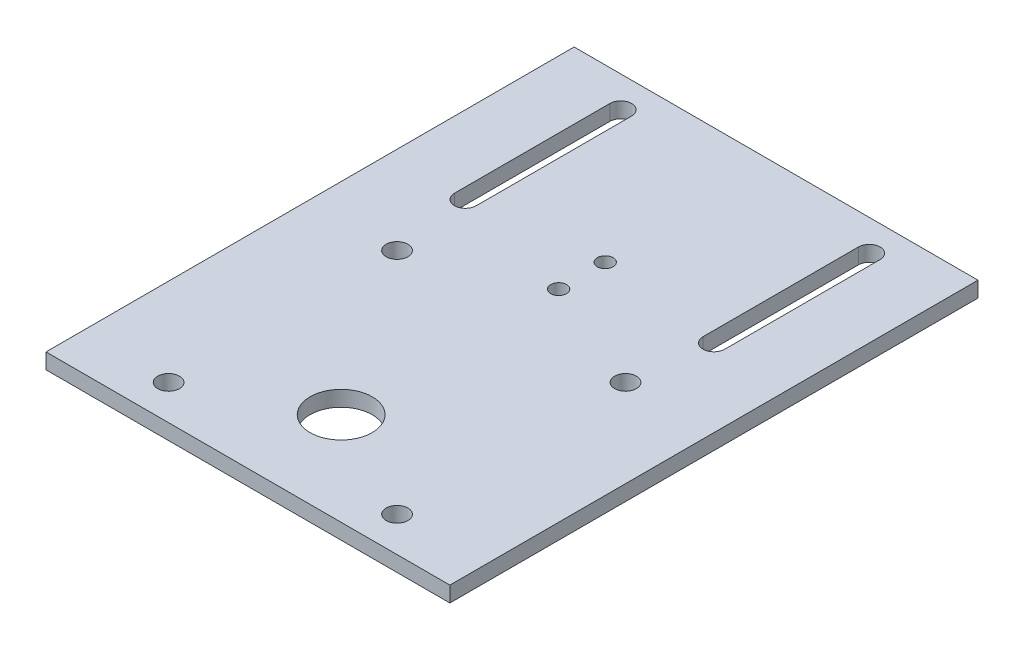
ISO-10303-21;
HEADER;
FILE_DESCRIPTION(('STEP AP214'),'2;1');
FILE_NAME('part.step','',(''),(''),'','','');
FILE_SCHEMA(('AUTOMOTIVE_DESIGN { 1 0 10303 214 1 1 1 1 }'));
ENDSEC;
DATA;
#1=APPLICATION_CONTEXT('core data for automotive mechanical design processes');
#2=APPLICATION_PROTOCOL_DEFINITION('international standard','automotive_design',2000,#1);
#3=PRODUCT_CONTEXT('',#1,'mechanical');
#4=PRODUCT('Part','Part','',(#3));
#5=PRODUCT_RELATED_PRODUCT_CATEGORY('part','',(#4));
#6=PRODUCT_DEFINITION_FORMATION('','',#4);
#7=PRODUCT_DEFINITION_CONTEXT('part definition',#1,'design');
#8=PRODUCT_DEFINITION('design','',#6,#7);
#9=PRODUCT_DEFINITION_SHAPE('','',#8);
#10=(LENGTH_UNIT() NAMED_UNIT(*) SI_UNIT(.MILLI.,.METRE.));
#11=(NAMED_UNIT(*) PLANE_ANGLE_UNIT() SI_UNIT($,.RADIAN.));
#12=(NAMED_UNIT(*) SI_UNIT($,.STERADIAN.) SOLID_ANGLE_UNIT());
#13=UNCERTAINTY_MEASURE_WITH_UNIT(LENGTH_MEASURE(1.E-05),#10,'distance_accuracy_value','');
#14=(GEOMETRIC_REPRESENTATION_CONTEXT(3) GLOBAL_UNCERTAINTY_ASSIGNED_CONTEXT((#13)) GLOBAL_UNIT_ASSIGNED_CONTEXT((#10,
#11,#12)) REPRESENTATION_CONTEXT('',''));
#15=CARTESIAN_POINT('',(0.,0.,0.));
#16=DIRECTION('',(0.,0.,1.));
#17=DIRECTION('',(1.,0.,0.));
#18=AXIS2_PLACEMENT_3D('',#15,#16,#17);
#19=CARTESIAN_POINT('',(-65.,5.,85.));
#20=DIRECTION('',(-1.,0.,0.));
#21=DIRECTION('',(0.,0.,1.));
#22=AXIS2_PLACEMENT_3D('',#19,#20,#21);
#23=PLANE('',#22);
#24=DIRECTION('',(0.,0.,-1.));
#25=VECTOR('',#24,1.);
#26=CARTESIAN_POINT('',(-65.,0.,85.));
#27=LINE('',#26,#25);
#28=CARTESIAN_POINT('',(-65.,0.,85.));
#29=VERTEX_POINT('',#28);
#30=CARTESIAN_POINT('',(-65.,0.,-85.));
#31=VERTEX_POINT('',#30);
#32=EDGE_CURVE('E231',#29,#31,#27,.T.);
#33=ORIENTED_EDGE('',*,*,#32,.F.);
#34=DIRECTION('',(0.,-1.,0.));
#35=VECTOR('',#34,1.);
#36=CARTESIAN_POINT('',(-65.,5.,85.));
#37=LINE('',#36,#35);
#38=CARTESIAN_POINT('',(-65.,5.,85.));
#39=VERTEX_POINT('',#38);
#40=EDGE_CURVE('E11',#39,#29,#37,.T.);
#41=ORIENTED_EDGE('',*,*,#40,.F.);
#42=DIRECTION('',(0.,0.,-1.));
#43=VECTOR('',#42,1.);
#44=CARTESIAN_POINT('',(-65.,5.,85.));
#45=LINE('',#44,#43);
#46=CARTESIAN_POINT('',(-65.,5.,-85.));
#47=VERTEX_POINT('',#46);
#48=EDGE_CURVE('E232',#39,#47,#45,.T.);
#49=ORIENTED_EDGE('',*,*,#48,.T.);
#50=DIRECTION('',(0.,-1.,0.));
#51=VECTOR('',#50,1.);
#52=CARTESIAN_POINT('',(-65.,5.,-85.));
#53=LINE('',#52,#51);
#54=EDGE_CURVE('E37',#47,#31,#53,.T.);
#55=ORIENTED_EDGE('',*,*,#54,.T.);
#56=EDGE_LOOP('',(#33,#41,#49,#55));
#57=FACE_BOUND('',#56,.T.);
#58=ADVANCED_FACE('F34',(#57),#23,.T.);
#59=CARTESIAN_POINT('',(-65.,5.,85.));
#60=DIRECTION('',(0.,0.,-1.));
#61=DIRECTION('',(-1.,0.,0.));
#62=AXIS2_PLACEMENT_3D('',#59,#60,#61);
#63=PLANE('',#62);
#64=DIRECTION('',(1.,0.,0.));
#65=VECTOR('',#64,1.);
#66=CARTESIAN_POINT('',(-65.,0.,85.));
#67=LINE('',#66,#65);
#68=CARTESIAN_POINT('',(65.,0.,85.));
#69=VERTEX_POINT('',#68);
#70=EDGE_CURVE('E236',#29,#69,#67,.T.);
#71=ORIENTED_EDGE('',*,*,#70,.T.);
#72=DIRECTION('',(0.,-1.,0.));
#73=VECTOR('',#72,1.);
#74=CARTESIAN_POINT('',(65.,5.,85.));
#75=LINE('',#74,#73);
#76=CARTESIAN_POINT('',(65.,5.,85.));
#77=VERTEX_POINT('',#76);
#78=EDGE_CURVE('E42',#77,#69,#75,.T.);
#79=ORIENTED_EDGE('',*,*,#78,.F.);
#80=DIRECTION('',(1.,0.,0.));
#81=VECTOR('',#80,1.);
#82=CARTESIAN_POINT('',(-65.,5.,85.));
#83=LINE('',#82,#81);
#84=EDGE_CURVE('E241',#39,#77,#83,.T.);
#85=ORIENTED_EDGE('',*,*,#84,.F.);
#86=ORIENTED_EDGE('',*,*,#40,.T.);
#87=EDGE_LOOP('',(#71,#79,#85,#86));
#88=FACE_BOUND('',#87,.T.);
#89=ADVANCED_FACE('F267',(#88),#63,.F.);
#90=CARTESIAN_POINT('',(65.,5.,85.));
#91=DIRECTION('',(-1.,0.,0.));
#92=DIRECTION('',(0.,0.,1.));
#93=AXIS2_PLACEMENT_3D('',#90,#91,#92);
#94=PLANE('',#93);
#95=DIRECTION('',(0.,0.,-1.));
#96=VECTOR('',#95,1.);
#97=CARTESIAN_POINT('',(65.,0.,85.));
#98=LINE('',#97,#96);
#99=CARTESIAN_POINT('',(65.,0.,-85.));
#100=VERTEX_POINT('',#99);
#101=EDGE_CURVE('E248',#69,#100,#98,.T.);
#102=ORIENTED_EDGE('',*,*,#101,.T.);
#103=DIRECTION('',(0.,-1.,0.));
#104=VECTOR('',#103,1.);
#105=CARTESIAN_POINT('',(65.,5.,-85.));
#106=LINE('',#105,#104);
#107=CARTESIAN_POINT('',(65.,5.,-85.));
#108=VERTEX_POINT('',#107);
#109=EDGE_CURVE('E253',#108,#100,#106,.T.);
#110=ORIENTED_EDGE('',*,*,#109,.F.);
#111=DIRECTION('',(0.,0.,-1.));
#112=VECTOR('',#111,1.);
#113=CARTESIAN_POINT('',(65.,5.,85.));
#114=LINE('',#113,#112);
#115=EDGE_CURVE('E239',#77,#108,#114,.T.);
#116=ORIENTED_EDGE('',*,*,#115,.F.);
#117=ORIENTED_EDGE('',*,*,#78,.T.);
#118=EDGE_LOOP('',(#102,#110,#116,#117));
#119=FACE_BOUND('',#118,.T.);
#120=ADVANCED_FACE('F271',(#119),#94,.F.);
#121=CARTESIAN_POINT('',(-65.,5.,-85.));
#122=DIRECTION('',(0.,0.,-1.));
#123=DIRECTION('',(-1.,0.,0.));
#124=AXIS2_PLACEMENT_3D('',#121,#122,#123);
#125=PLANE('',#124);
#126=DIRECTION('',(1.,0.,0.));
#127=VECTOR('',#126,1.);
#128=CARTESIAN_POINT('',(-65.,0.,-85.));
#129=LINE('',#128,#127);
#130=EDGE_CURVE('E245',#31,#100,#129,.T.);
#131=ORIENTED_EDGE('',*,*,#130,.F.);
#132=ORIENTED_EDGE('',*,*,#54,.F.);
#133=DIRECTION('',(1.,0.,0.));
#134=VECTOR('',#133,1.);
#135=CARTESIAN_POINT('',(-65.,5.,-85.));
#136=LINE('',#135,#134);
#137=EDGE_CURVE('E235',#47,#108,#136,.T.);
#138=ORIENTED_EDGE('',*,*,#137,.T.);
#139=ORIENTED_EDGE('',*,*,#109,.T.);
#140=EDGE_LOOP('',(#131,#132,#138,#139));
#141=FACE_BOUND('',#140,.T.);
#142=ADVANCED_FACE('F261',(#141),#125,.T.);
#143=CARTESIAN_POINT('',(0.,5.,0.));
#144=DIRECTION('',(0.,-1.,0.));
#145=DIRECTION('',(0.,0.,-1.));
#146=AXIS2_PLACEMENT_3D('',#143,#144,#145);
#147=PLANE('',#146);
#148=CARTESIAN_POINT('',(-36.7695526217005,5.,0.230447378299511));
#149=DIRECTION('',(0.,-1.,0.));
#150=DIRECTION('',(0.,0.,-1.));
#151=AXIS2_PLACEMENT_3D('',#148,#149,#150);
#152=CIRCLE('',#151,3.5);
#153=CARTESIAN_POINT('',(-36.7695526217005,5.,-3.26955262170049));
#154=VERTEX_POINT('',#153);
#155=EDGE_CURVE('E222',#154,#154,#152,.T.);
#156=ORIENTED_EDGE('',*,*,#155,.T.);
#157=EDGE_LOOP('',(#156));
#158=FACE_BOUND('',#157,.T.);
#159=CARTESIAN_POINT('',(-36.7695526217005,5.,73.7695526217005));
#160=DIRECTION('',(0.,-1.,0.));
#161=DIRECTION('',(0.,0.,-1.));
#162=AXIS2_PLACEMENT_3D('',#159,#160,#161);
#163=CIRCLE('',#162,3.5);
#164=CARTESIAN_POINT('',(-36.7695526217005,5.,70.2695526217005));
#165=VERTEX_POINT('',#164);
#166=EDGE_CURVE('E219',#165,#165,#163,.T.);
#167=ORIENTED_EDGE('',*,*,#166,.T.);
#168=EDGE_LOOP('',(#167));
#169=FACE_BOUND('',#168,.T.);
#170=CARTESIAN_POINT('',(36.7695526217005,5.,73.7695526217005));
#171=DIRECTION('',(0.,-1.,0.));
#172=DIRECTION('',(0.,0.,-1.));
#173=AXIS2_PLACEMENT_3D('',#170,#171,#172);
#174=CIRCLE('',#173,3.5);
#175=CARTESIAN_POINT('',(36.7695526217005,5.,70.2695526217005));
#176=VERTEX_POINT('',#175);
#177=EDGE_CURVE('E216',#176,#176,#174,.T.);
#178=ORIENTED_EDGE('',*,*,#177,.T.);
#179=EDGE_LOOP('',(#178));
#180=FACE_BOUND('',#179,.T.);
#181=DIRECTION('',(0.,0.,-1.));
#182=VECTOR('',#181,1.);
#183=CARTESIAN_POINT('',(36.5,5.,0.));
#184=LINE('',#183,#182);
#185=CARTESIAN_POINT('',(36.5,5.,-25.));
#186=VERTEX_POINT('',#185);
#187=CARTESIAN_POINT('',(36.5,5.,-75.));
#188=VERTEX_POINT('',#187);
#189=EDGE_CURVE('E210',#186,#188,#184,.T.);
#190=ORIENTED_EDGE('',*,*,#189,.T.);
#191=CARTESIAN_POINT('',(40.,5.,-75.));
#192=DIRECTION('',(0.,-1.,0.));
#193=DIRECTION('',(0.,0.,-1.));
#194=AXIS2_PLACEMENT_3D('',#191,#192,#193);
#195=CIRCLE('',#194,3.50000000000002);
#196=CARTESIAN_POINT('',(43.5,5.,-75.));
#197=VERTEX_POINT('',#196);
#198=EDGE_CURVE('E213',#188,#197,#195,.T.);
#199=ORIENTED_EDGE('',*,*,#198,.T.);
#200=DIRECTION('',(0.,0.,1.));
#201=VECTOR('',#200,1.);
#202=CARTESIAN_POINT('',(43.5,5.,0.));
#203=LINE('',#202,#201);
#204=CARTESIAN_POINT('',(43.5,5.,-25.));
#205=VERTEX_POINT('',#204);
#206=EDGE_CURVE('E204',#197,#205,#203,.T.);
#207=ORIENTED_EDGE('',*,*,#206,.T.);
#208=CARTESIAN_POINT('',(40.,5.,-25.));
#209=DIRECTION('',(0.,-1.,0.));
#210=DIRECTION('',(0.,0.,-1.));
#211=AXIS2_PLACEMENT_3D('',#208,#209,#210);
#212=CIRCLE('',#211,3.5);
#213=EDGE_CURVE('E207',#205,#186,#212,.T.);
#214=ORIENTED_EDGE('',*,*,#213,.T.);
#215=EDGE_LOOP('',(#190,#199,#207,#214));
#216=FACE_BOUND('',#215,.T.);
#217=CARTESIAN_POINT('',(0.,5.,-30.));
#218=DIRECTION('',(0.,-1.,0.));
#219=DIRECTION('',(0.,0.,-1.));
#220=AXIS2_PLACEMENT_3D('',#217,#218,#219);
#221=CIRCLE('',#220,2.55);
#222=CARTESIAN_POINT('',(0.,5.,-32.55));
#223=VERTEX_POINT('',#222);
#224=EDGE_CURVE('E201',#223,#223,#221,.T.);
#225=ORIENTED_EDGE('',*,*,#224,.T.);
#226=EDGE_LOOP('',(#225));
#227=FACE_BOUND('',#226,.T.);
#228=CARTESIAN_POINT('',(0.,5.,-15.));
#229=DIRECTION('',(0.,-1.,0.));
#230=DIRECTION('',(0.,0.,-1.));
#231=AXIS2_PLACEMENT_3D('',#228,#229,#230);
#232=CIRCLE('',#231,2.55);
#233=CARTESIAN_POINT('',(0.,5.,-17.55));
#234=VERTEX_POINT('',#233);
#235=EDGE_CURVE('E198',#234,#234,#232,.T.);
#236=ORIENTED_EDGE('',*,*,#235,.T.);
#237=EDGE_LOOP('',(#236));
#238=FACE_BOUND('',#237,.T.);
#239=DIRECTION('',(0.,0.,-1.));
#240=VECTOR('',#239,1.);
#241=CARTESIAN_POINT('',(-43.5,5.,0.));
#242=LINE('',#241,#240);
#243=CARTESIAN_POINT('',(-43.5,5.,-25.));
#244=VERTEX_POINT('',#243);
#245=CARTESIAN_POINT('',(-43.5,5.,-75.));
#246=VERTEX_POINT('',#245);
#247=EDGE_CURVE('E192',#244,#246,#242,.T.);
#248=ORIENTED_EDGE('',*,*,#247,.T.);
#249=CARTESIAN_POINT('',(-40.,5.,-75.));
#250=DIRECTION('',(0.,-1.,0.));
#251=DIRECTION('',(0.,0.,-1.));
#252=AXIS2_PLACEMENT_3D('',#249,#250,#251);
#253=CIRCLE('',#252,3.50000000000002);
#254=CARTESIAN_POINT('',(-36.5,5.,-75.));
#255=VERTEX_POINT('',#254);
#256=EDGE_CURVE('E195',#246,#255,#253,.T.);
#257=ORIENTED_EDGE('',*,*,#256,.T.);
#258=DIRECTION('',(0.,0.,1.));
#259=VECTOR('',#258,1.);
#260=CARTESIAN_POINT('',(-36.5,5.,0.));
#261=LINE('',#260,#259);
#262=CARTESIAN_POINT('',(-36.5,5.,-25.));
#263=VERTEX_POINT('',#262);
#264=EDGE_CURVE('E189',#255,#263,#261,.T.);
#265=ORIENTED_EDGE('',*,*,#264,.T.);
#266=CARTESIAN_POINT('',(-40.,5.,-25.));
#267=DIRECTION('',(0.,-1.,0.));
#268=DIRECTION('',(0.,0.,-1.));
#269=AXIS2_PLACEMENT_3D('',#266,#267,#268);
#270=CIRCLE('',#269,3.5);
#271=EDGE_CURVE('E128',#263,#244,#270,.T.);
#272=ORIENTED_EDGE('',*,*,#271,.T.);
#273=EDGE_LOOP('',(#248,#257,#265,#272));
#274=FACE_BOUND('',#273,.T.);
#275=CARTESIAN_POINT('',(36.7695526217005,5.,0.230447378299518));
#276=DIRECTION('',(0.,-1.,0.));
#277=DIRECTION('',(0.,0.,-1.));
#278=AXIS2_PLACEMENT_3D('',#275,#276,#277);
#279=CIRCLE('',#278,3.5);
#280=CARTESIAN_POINT('',(36.7695526217005,5.,-3.26955262170048));
#281=VERTEX_POINT('',#280);
#282=EDGE_CURVE('E186',#281,#281,#279,.T.);
#283=ORIENTED_EDGE('',*,*,#282,.T.);
#284=EDGE_LOOP('',(#283));
#285=FACE_BOUND('',#284,.T.);
#286=CARTESIAN_POINT('',(0.,5.,55.));
#287=DIRECTION('',(0.,-1.,0.));
#288=DIRECTION('',(0.,0.,-1.));
#289=AXIS2_PLACEMENT_3D('',#286,#287,#288);
#290=CIRCLE('',#289,10.);
#291=CARTESIAN_POINT('',(0.,5.,45.));
#292=VERTEX_POINT('',#291);
#293=EDGE_CURVE('E228',#292,#292,#290,.T.);
#294=ORIENTED_EDGE('',*,*,#293,.T.);
#295=EDGE_LOOP('',(#294));
#296=FACE_BOUND('',#295,.T.);
#297=ORIENTED_EDGE('',*,*,#48,.F.);
#298=ORIENTED_EDGE('',*,*,#84,.T.);
#299=ORIENTED_EDGE('',*,*,#115,.T.);
#300=ORIENTED_EDGE('',*,*,#137,.F.);
#301=EDGE_LOOP('',(#297,#298,#299,#300));
#302=FACE_BOUND('',#301,.T.);
#303=ADVANCED_FACE('F273',(#158,#169,#180,#216,#227,#238,#274,#285,#296,#302),#147,.F.);
#304=CARTESIAN_POINT('',(0.,0.,0.));
#305=DIRECTION('',(0.,-1.,0.));
#306=DIRECTION('',(0.,0.,-1.));
#307=AXIS2_PLACEMENT_3D('',#304,#305,#306);
#308=PLANE('',#307);
#309=CARTESIAN_POINT('',(-36.7695526217005,0.,0.230447378299511));
#310=DIRECTION('',(0.,-1.,0.));
#311=DIRECTION('',(0.,0.,-1.));
#312=AXIS2_PLACEMENT_3D('',#309,#310,#311);
#313=CIRCLE('',#312,3.5);
#314=CARTESIAN_POINT('',(-36.7695526217005,0.,-3.26955262170049));
#315=VERTEX_POINT('',#314);
#316=EDGE_CURVE('E155',#315,#315,#313,.T.);
#317=ORIENTED_EDGE('',*,*,#316,.F.);
#318=EDGE_LOOP('',(#317));
#319=FACE_BOUND('',#318,.T.);
#320=CARTESIAN_POINT('',(-36.7695526217005,0.,73.7695526217005));
#321=DIRECTION('',(0.,-1.,0.));
#322=DIRECTION('',(0.,0.,-1.));
#323=AXIS2_PLACEMENT_3D('',#320,#321,#322);
#324=CIRCLE('',#323,3.5);
#325=CARTESIAN_POINT('',(-36.7695526217005,0.,70.2695526217005));
#326=VERTEX_POINT('',#325);
#327=EDGE_CURVE('E159',#326,#326,#324,.T.);
#328=ORIENTED_EDGE('',*,*,#327,.F.);
#329=EDGE_LOOP('',(#328));
#330=FACE_BOUND('',#329,.T.);
#331=CARTESIAN_POINT('',(36.7695526217005,0.,73.7695526217005));
#332=DIRECTION('',(0.,-1.,0.));
#333=DIRECTION('',(0.,0.,-1.));
#334=AXIS2_PLACEMENT_3D('',#331,#332,#333);
#335=CIRCLE('',#334,3.5);
#336=CARTESIAN_POINT('',(36.7695526217005,0.,70.2695526217005));
#337=VERTEX_POINT('',#336);
#338=EDGE_CURVE('E162',#337,#337,#335,.T.);
#339=ORIENTED_EDGE('',*,*,#338,.F.);
#340=EDGE_LOOP('',(#339));
#341=FACE_BOUND('',#340,.T.);
#342=CARTESIAN_POINT('',(40.,0.,-75.));
#343=DIRECTION('',(0.,-1.,0.));
#344=DIRECTION('',(0.,0.,-1.));
#345=AXIS2_PLACEMENT_3D('',#342,#343,#344);
#346=CIRCLE('',#345,3.50000000000002);
#347=CARTESIAN_POINT('',(36.5,0.,-75.));
#348=VERTEX_POINT('',#347);
#349=CARTESIAN_POINT('',(43.5,0.,-75.));
#350=VERTEX_POINT('',#349);
#351=EDGE_CURVE('E166',#348,#350,#346,.T.);
#352=ORIENTED_EDGE('',*,*,#351,.F.);
#353=DIRECTION('',(0.,0.,-1.));
#354=VECTOR('',#353,1.);
#355=CARTESIAN_POINT('',(36.5,0.,-75.));
#356=LINE('',#355,#354);
#357=CARTESIAN_POINT('',(36.5,0.,-25.));
#358=VERTEX_POINT('',#357);
#359=EDGE_CURVE('E174',#358,#348,#356,.T.);
#360=ORIENTED_EDGE('',*,*,#359,.F.);
#361=CARTESIAN_POINT('',(40.,0.,-25.));
#362=DIRECTION('',(0.,-1.,0.));
#363=DIRECTION('',(0.,0.,-1.));
#364=AXIS2_PLACEMENT_3D('',#361,#362,#363);
#365=CIRCLE('',#364,3.5);
#366=CARTESIAN_POINT('',(43.5,0.,-25.));
#367=VERTEX_POINT('',#366);
#368=EDGE_CURVE('E171',#367,#358,#365,.T.);
#369=ORIENTED_EDGE('',*,*,#368,.F.);
#370=DIRECTION('',(0.,0.,1.));
#371=VECTOR('',#370,1.);
#372=CARTESIAN_POINT('',(43.5,0.,-75.));
#373=LINE('',#372,#371);
#374=EDGE_CURVE('E168',#350,#367,#373,.T.);
#375=ORIENTED_EDGE('',*,*,#374,.F.);
#376=EDGE_LOOP('',(#352,#360,#369,#375));
#377=FACE_BOUND('',#376,.T.);
#378=CARTESIAN_POINT('',(0.,0.,-30.));
#379=DIRECTION('',(0.,-1.,0.));
#380=DIRECTION('',(0.,0.,-1.));
#381=AXIS2_PLACEMENT_3D('',#378,#379,#380);
#382=CIRCLE('',#381,2.55);
#383=CARTESIAN_POINT('',(0.,0.,-32.55));
#384=VERTEX_POINT('',#383);
#385=EDGE_CURVE('E169',#384,#384,#382,.T.);
#386=ORIENTED_EDGE('',*,*,#385,.F.);
#387=EDGE_LOOP('',(#386));
#388=FACE_BOUND('',#387,.T.);
#389=CARTESIAN_POINT('',(0.,0.,-15.));
#390=DIRECTION('',(0.,-1.,0.));
#391=DIRECTION('',(0.,0.,-1.));
#392=AXIS2_PLACEMENT_3D('',#389,#390,#391);
#393=CIRCLE('',#392,2.55);
#394=CARTESIAN_POINT('',(0.,0.,-17.55));
#395=VERTEX_POINT('',#394);
#396=EDGE_CURVE('E152',#395,#395,#393,.T.);
#397=ORIENTED_EDGE('',*,*,#396,.F.);
#398=EDGE_LOOP('',(#397));
#399=FACE_BOUND('',#398,.T.);
#400=CARTESIAN_POINT('',(-40.,0.,-75.));
#401=DIRECTION('',(0.,-1.,0.));
#402=DIRECTION('',(0.,0.,1.));
#403=AXIS2_PLACEMENT_3D('',#400,#401,#402);
#404=CIRCLE('',#403,3.50000000000002);
#405=CARTESIAN_POINT('',(-43.5,0.,-75.));
#406=VERTEX_POINT('',#405);
#407=CARTESIAN_POINT('',(-36.5,0.,-75.));
#408=VERTEX_POINT('',#407);
#409=EDGE_CURVE('E140',#406,#408,#404,.T.);
#410=ORIENTED_EDGE('',*,*,#409,.F.);
#411=DIRECTION('',(0.,0.,-1.));
#412=VECTOR('',#411,1.);
#413=CARTESIAN_POINT('',(-43.5,0.,-75.));
#414=LINE('',#413,#412);
#415=CARTESIAN_POINT('',(-43.5,0.,-25.));
#416=VERTEX_POINT('',#415);
#417=EDGE_CURVE('E145',#416,#406,#414,.T.);
#418=ORIENTED_EDGE('',*,*,#417,.F.);
#419=CARTESIAN_POINT('',(-40.,0.,-25.));
#420=DIRECTION('',(0.,-1.,0.));
#421=DIRECTION('',(0.,0.,1.));
#422=AXIS2_PLACEMENT_3D('',#419,#420,#421);
#423=CIRCLE('',#422,3.5);
#424=CARTESIAN_POINT('',(-36.5,0.,-25.));
#425=VERTEX_POINT('',#424);
#426=EDGE_CURVE('E125',#425,#416,#423,.T.);
#427=ORIENTED_EDGE('',*,*,#426,.F.);
#428=DIRECTION('',(0.,0.,1.));
#429=VECTOR('',#428,1.);
#430=CARTESIAN_POINT('',(-36.5,0.,-75.));
#431=LINE('',#430,#429);
#432=EDGE_CURVE('E135',#408,#425,#431,.T.);
#433=ORIENTED_EDGE('',*,*,#432,.F.);
#434=EDGE_LOOP('',(#410,#418,#427,#433));
#435=FACE_BOUND('',#434,.T.);
#436=CARTESIAN_POINT('',(36.7695526217005,0.,0.230447378299518));
#437=DIRECTION('',(0.,-1.,0.));
#438=DIRECTION('',(0.,0.,-1.));
#439=AXIS2_PLACEMENT_3D('',#436,#437,#438);
#440=CIRCLE('',#439,3.5);
#441=CARTESIAN_POINT('',(36.7695526217005,0.,-3.26955262170048));
#442=VERTEX_POINT('',#441);
#443=EDGE_CURVE('E158',#442,#442,#440,.T.);
#444=ORIENTED_EDGE('',*,*,#443,.F.);
#445=EDGE_LOOP('',(#444));
#446=FACE_BOUND('',#445,.T.);
#447=CARTESIAN_POINT('',(0.,0.,55.));
#448=DIRECTION('',(0.,-1.,0.));
#449=DIRECTION('',(0.,0.,-1.));
#450=AXIS2_PLACEMENT_3D('',#447,#448,#449);
#451=CIRCLE('',#450,10.);
#452=CARTESIAN_POINT('',(0.,0.,45.));
#453=VERTEX_POINT('',#452);
#454=EDGE_CURVE('E225',#453,#453,#451,.T.);
#455=ORIENTED_EDGE('',*,*,#454,.F.);
#456=EDGE_LOOP('',(#455));
#457=FACE_BOUND('',#456,.T.);
#458=ORIENTED_EDGE('',*,*,#32,.T.);
#459=ORIENTED_EDGE('',*,*,#130,.T.);
#460=ORIENTED_EDGE('',*,*,#101,.F.);
#461=ORIENTED_EDGE('',*,*,#70,.F.);
#462=EDGE_LOOP('',(#458,#459,#460,#461));
#463=FACE_BOUND('',#462,.T.);
#464=ADVANCED_FACE('F142',(#319,#330,#341,#377,#388,#399,#435,#446,#457,#463),#308,.T.);
#465=CARTESIAN_POINT('',(0.,10.,55.));
#466=DIRECTION('',(0.,-1.,0.));
#467=DIRECTION('',(0.,0.,-1.));
#468=AXIS2_PLACEMENT_3D('',#465,#466,#467);
#469=CYLINDRICAL_SURFACE('',#468,10.);
#470=ORIENTED_EDGE('',*,*,#454,.T.);
#471=EDGE_LOOP('',(#470));
#472=FACE_BOUND('',#471,.T.);
#473=ORIENTED_EDGE('',*,*,#293,.F.);
#474=EDGE_LOOP('',(#473));
#475=FACE_BOUND('',#474,.T.);
#476=ADVANCED_FACE('F281',(#472,#475),#469,.F.);
#477=CARTESIAN_POINT('',(36.7695526217005,10.,0.230447378299518));
#478=DIRECTION('',(0.,-1.,0.));
#479=DIRECTION('',(0.,0.,-1.));
#480=AXIS2_PLACEMENT_3D('',#477,#478,#479);
#481=CYLINDRICAL_SURFACE('',#480,3.5);
#482=ORIENTED_EDGE('',*,*,#443,.T.);
#483=EDGE_LOOP('',(#482));
#484=FACE_BOUND('',#483,.T.);
#485=ORIENTED_EDGE('',*,*,#282,.F.);
#486=EDGE_LOOP('',(#485));
#487=FACE_BOUND('',#486,.T.);
#488=ADVANCED_FACE('F310',(#484,#487),#481,.F.);
#489=CARTESIAN_POINT('',(-40.,10.,-75.));
#490=DIRECTION('',(0.,-1.,0.));
#491=DIRECTION('',(0.,0.,-1.));
#492=AXIS2_PLACEMENT_3D('',#489,#490,#491);
#493=CYLINDRICAL_SURFACE('',#492,3.50000000000002);
#494=DIRECTION('',(0.,-1.,0.));
#495=VECTOR('',#494,1.);
#496=CARTESIAN_POINT('',(-43.5,10.,-75.));
#497=LINE('',#496,#495);
#498=EDGE_CURVE('E150',#246,#406,#497,.T.);
#499=ORIENTED_EDGE('',*,*,#498,.T.);
#500=ORIENTED_EDGE('',*,*,#409,.T.);
#501=DIRECTION('',(0.,-1.,0.));
#502=VECTOR('',#501,1.);
#503=CARTESIAN_POINT('',(-36.5,10.,-75.));
#504=LINE('',#503,#502);
#505=EDGE_CURVE('E131',#255,#408,#504,.T.);
#506=ORIENTED_EDGE('',*,*,#505,.F.);
#507=ORIENTED_EDGE('',*,*,#256,.F.);
#508=EDGE_LOOP('',(#499,#500,#506,#507));
#509=FACE_BOUND('',#508,.T.);
#510=ADVANCED_FACE('F329',(#509),#493,.F.);
#511=CARTESIAN_POINT('',(-43.5,10.,-75.));
#512=DIRECTION('',(-1.,0.,0.));
#513=DIRECTION('',(0.,0.,1.));
#514=AXIS2_PLACEMENT_3D('',#511,#512,#513);
#515=PLANE('',#514);
#516=DIRECTION('',(0.,-1.,0.));
#517=VECTOR('',#516,1.);
#518=CARTESIAN_POINT('',(-43.5,10.,-25.));
#519=LINE('',#518,#517);
#520=EDGE_CURVE('E130',#244,#416,#519,.T.);
#521=ORIENTED_EDGE('',*,*,#520,.T.);
#522=ORIENTED_EDGE('',*,*,#417,.T.);
#523=ORIENTED_EDGE('',*,*,#498,.F.);
#524=ORIENTED_EDGE('',*,*,#247,.F.);
#525=EDGE_LOOP('',(#521,#522,#523,#524));
#526=FACE_BOUND('',#525,.T.);
#527=ADVANCED_FACE('F339',(#526),#515,.F.);
#528=CARTESIAN_POINT('',(-40.,10.,-25.));
#529=DIRECTION('',(0.,-1.,0.));
#530=DIRECTION('',(0.,0.,-1.));
#531=AXIS2_PLACEMENT_3D('',#528,#529,#530);
#532=CYLINDRICAL_SURFACE('',#531,3.5);
#533=DIRECTION('',(0.,-1.,0.));
#534=VECTOR('',#533,1.);
#535=CARTESIAN_POINT('',(-36.5,10.,-25.));
#536=LINE('',#535,#534);
#537=EDGE_CURVE('E58',#263,#425,#536,.T.);
#538=ORIENTED_EDGE('',*,*,#537,.T.);
#539=ORIENTED_EDGE('',*,*,#426,.T.);
#540=ORIENTED_EDGE('',*,*,#520,.F.);
#541=ORIENTED_EDGE('',*,*,#271,.F.);
#542=EDGE_LOOP('',(#538,#539,#540,#541));
#543=FACE_BOUND('',#542,.T.);
#544=ADVANCED_FACE('F122',(#543),#532,.F.);
#545=CARTESIAN_POINT('',(-36.5,10.,-75.));
#546=DIRECTION('',(1.,0.,0.));
#547=DIRECTION('',(0.,0.,-1.));
#548=AXIS2_PLACEMENT_3D('',#545,#546,#547);
#549=PLANE('',#548);
#550=ORIENTED_EDGE('',*,*,#505,.T.);
#551=ORIENTED_EDGE('',*,*,#432,.T.);
#552=ORIENTED_EDGE('',*,*,#537,.F.);
#553=ORIENTED_EDGE('',*,*,#264,.F.);
#554=EDGE_LOOP('',(#550,#551,#552,#553));
#555=FACE_BOUND('',#554,.T.);
#556=ADVANCED_FACE('F136',(#555),#549,.F.);
#557=CARTESIAN_POINT('',(0.,10.,-15.));
#558=DIRECTION('',(0.,-1.,0.));
#559=DIRECTION('',(0.,0.,-1.));
#560=AXIS2_PLACEMENT_3D('',#557,#558,#559);
#561=CYLINDRICAL_SURFACE('',#560,2.55);
#562=ORIENTED_EDGE('',*,*,#396,.T.);
#563=EDGE_LOOP('',(#562));
#564=FACE_BOUND('',#563,.T.);
#565=ORIENTED_EDGE('',*,*,#235,.F.);
#566=EDGE_LOOP('',(#565));
#567=FACE_BOUND('',#566,.T.);
#568=ADVANCED_FACE('F366',(#564,#567),#561,.F.);
#569=CARTESIAN_POINT('',(0.,10.,-30.));
#570=DIRECTION('',(0.,-1.,0.));
#571=DIRECTION('',(0.,0.,-1.));
#572=AXIS2_PLACEMENT_3D('',#569,#570,#571);
#573=CYLINDRICAL_SURFACE('',#572,2.55);
#574=ORIENTED_EDGE('',*,*,#385,.T.);
#575=EDGE_LOOP('',(#574));
#576=FACE_BOUND('',#575,.T.);
#577=ORIENTED_EDGE('',*,*,#224,.F.);
#578=EDGE_LOOP('',(#577));
#579=FACE_BOUND('',#578,.T.);
#580=ADVANCED_FACE('F375',(#576,#579),#573,.F.);
#581=CARTESIAN_POINT('',(40.,10.,-75.));
#582=DIRECTION('',(0.,-1.,0.));
#583=DIRECTION('',(0.,0.,-1.));
#584=AXIS2_PLACEMENT_3D('',#581,#582,#583);
#585=CYLINDRICAL_SURFACE('',#584,3.50000000000002);
#586=DIRECTION('',(0.,-1.,0.));
#587=VECTOR('',#586,1.);
#588=CARTESIAN_POINT('',(36.5,10.,-75.));
#589=LINE('',#588,#587);
#590=EDGE_CURVE('E165',#188,#348,#589,.T.);
#591=ORIENTED_EDGE('',*,*,#590,.T.);
#592=ORIENTED_EDGE('',*,*,#351,.T.);
#593=DIRECTION('',(0.,-1.,0.));
#594=VECTOR('',#593,1.);
#595=CARTESIAN_POINT('',(43.5,10.,-75.));
#596=LINE('',#595,#594);
#597=EDGE_CURVE('E177',#197,#350,#596,.T.);
#598=ORIENTED_EDGE('',*,*,#597,.F.);
#599=ORIENTED_EDGE('',*,*,#198,.F.);
#600=EDGE_LOOP('',(#591,#592,#598,#599));
#601=FACE_BOUND('',#600,.T.);
#602=ADVANCED_FACE('F385',(#601),#585,.F.);
#603=CARTESIAN_POINT('',(36.5,10.,-75.));
#604=DIRECTION('',(-1.,0.,0.));
#605=DIRECTION('',(0.,0.,1.));
#606=AXIS2_PLACEMENT_3D('',#603,#604,#605);
#607=PLANE('',#606);
#608=DIRECTION('',(0.,-1.,0.));
#609=VECTOR('',#608,1.);
#610=CARTESIAN_POINT('',(36.5,10.,-25.));
#611=LINE('',#610,#609);
#612=EDGE_CURVE('E179',#186,#358,#611,.T.);
#613=ORIENTED_EDGE('',*,*,#612,.T.);
#614=ORIENTED_EDGE('',*,*,#359,.T.);
#615=ORIENTED_EDGE('',*,*,#590,.F.);
#616=ORIENTED_EDGE('',*,*,#189,.F.);
#617=EDGE_LOOP('',(#613,#614,#615,#616));
#618=FACE_BOUND('',#617,.T.);
#619=ADVANCED_FACE('F395',(#618),#607,.F.);
#620=CARTESIAN_POINT('',(40.,10.,-25.));
#621=DIRECTION('',(0.,-1.,0.));
#622=DIRECTION('',(0.,0.,-1.));
#623=AXIS2_PLACEMENT_3D('',#620,#621,#622);
#624=CYLINDRICAL_SURFACE('',#623,3.5);
#625=DIRECTION('',(0.,-1.,0.));
#626=VECTOR('',#625,1.);
#627=CARTESIAN_POINT('',(43.5,10.,-25.));
#628=LINE('',#627,#626);
#629=EDGE_CURVE('E50',#205,#367,#628,.T.);
#630=ORIENTED_EDGE('',*,*,#629,.T.);
#631=ORIENTED_EDGE('',*,*,#368,.T.);
#632=ORIENTED_EDGE('',*,*,#612,.F.);
#633=ORIENTED_EDGE('',*,*,#213,.F.);
#634=EDGE_LOOP('',(#630,#631,#632,#633));
#635=FACE_BOUND('',#634,.T.);
#636=ADVANCED_FACE('F405',(#635),#624,.F.);
#637=CARTESIAN_POINT('',(43.5,10.,-75.));
#638=DIRECTION('',(1.,0.,0.));
#639=DIRECTION('',(0.,0.,-1.));
#640=AXIS2_PLACEMENT_3D('',#637,#638,#639);
#641=PLANE('',#640);
#642=ORIENTED_EDGE('',*,*,#597,.T.);
#643=ORIENTED_EDGE('',*,*,#374,.T.);
#644=ORIENTED_EDGE('',*,*,#629,.F.);
#645=ORIENTED_EDGE('',*,*,#206,.F.);
#646=EDGE_LOOP('',(#642,#643,#644,#645));
#647=FACE_BOUND('',#646,.T.);
#648=ADVANCED_FACE('F415',(#647),#641,.F.);
#649=CARTESIAN_POINT('',(36.7695526217005,10.,73.7695526217005));
#650=DIRECTION('',(0.,-1.,0.));
#651=DIRECTION('',(0.,0.,-1.));
#652=AXIS2_PLACEMENT_3D('',#649,#650,#651);
#653=CYLINDRICAL_SURFACE('',#652,3.5);
#654=ORIENTED_EDGE('',*,*,#338,.T.);
#655=EDGE_LOOP('',(#654));
#656=FACE_BOUND('',#655,.T.);
#657=ORIENTED_EDGE('',*,*,#177,.F.);
#658=EDGE_LOOP('',(#657));
#659=FACE_BOUND('',#658,.T.);
#660=ADVANCED_FACE('F425',(#656,#659),#653,.F.);
#661=CARTESIAN_POINT('',(-36.7695526217005,10.,73.7695526217005));
#662=DIRECTION('',(0.,-1.,0.));
#663=DIRECTION('',(0.,0.,-1.));
#664=AXIS2_PLACEMENT_3D('',#661,#662,#663);
#665=CYLINDRICAL_SURFACE('',#664,3.5);
#666=ORIENTED_EDGE('',*,*,#327,.T.);
#667=EDGE_LOOP('',(#666));
#668=FACE_BOUND('',#667,.T.);
#669=ORIENTED_EDGE('',*,*,#166,.F.);
#670=EDGE_LOOP('',(#669));
#671=FACE_BOUND('',#670,.T.);
#672=ADVANCED_FACE('F434',(#668,#671),#665,.F.);
#673=CARTESIAN_POINT('',(-36.7695526217005,10.,0.230447378299511));
#674=DIRECTION('',(0.,-1.,0.));
#675=DIRECTION('',(0.,0.,-1.));
#676=AXIS2_PLACEMENT_3D('',#673,#674,#675);
#677=CYLINDRICAL_SURFACE('',#676,3.5);
#678=ORIENTED_EDGE('',*,*,#316,.T.);
#679=EDGE_LOOP('',(#678));
#680=FACE_BOUND('',#679,.T.);
#681=ORIENTED_EDGE('',*,*,#155,.F.);
#682=EDGE_LOOP('',(#681));
#683=FACE_BOUND('',#682,.T.);
#684=ADVANCED_FACE('F444',(#680,#683),#677,.F.);
#685=CLOSED_SHELL('',(#58,#89,#120,#142,#303,#464,#476,#488,#510,#527,#544,#556,#568,#580,#602,
#619,#636,#648,#660,#672,#684));
#686=MANIFOLD_SOLID_BREP('B2',#685);
#687=ADVANCED_BREP_SHAPE_REPRESENTATION('',(#18,#686),#14);
#688=SHAPE_DEFINITION_REPRESENTATION(#9,#687);
ENDSEC;
END-ISO-10303-21;
